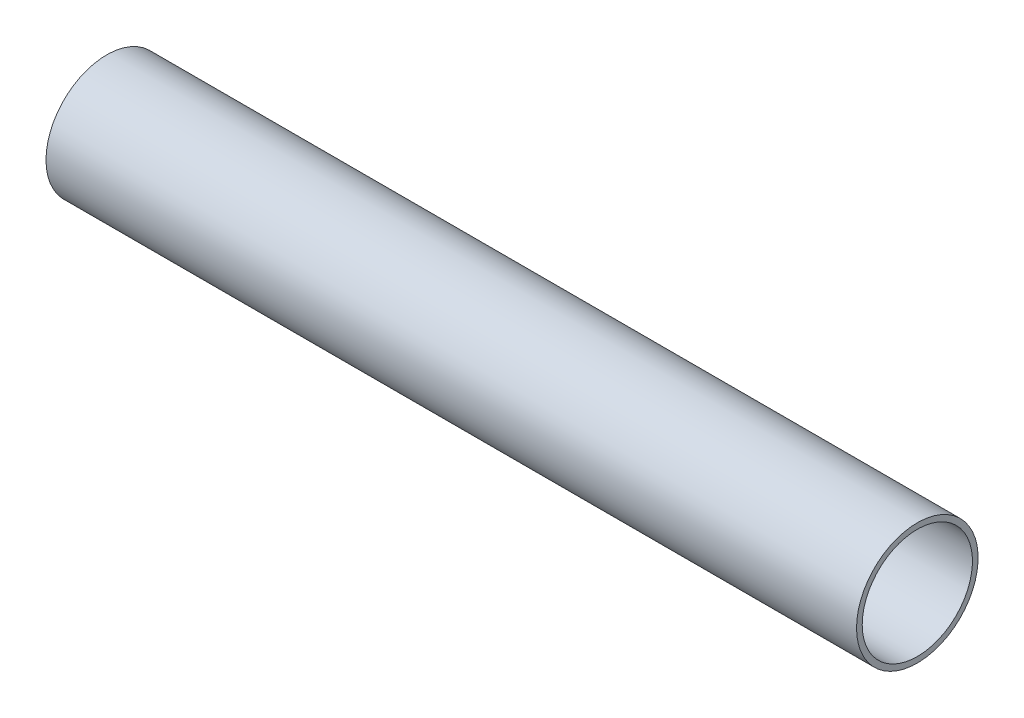
ISO-10303-21;
HEADER;
FILE_DESCRIPTION(('STEP AP214'),'2;1');
FILE_NAME('part.step','',(''),(''),'','','');
FILE_SCHEMA(('AUTOMOTIVE_DESIGN { 1 0 10303 214 1 1 1 1 }'));
ENDSEC;
DATA;
#1=APPLICATION_CONTEXT('core data for automotive mechanical design processes');
#2=APPLICATION_PROTOCOL_DEFINITION('international standard','automotive_design',2000,#1);
#3=PRODUCT_CONTEXT('',#1,'mechanical');
#4=PRODUCT('Part','Part','',(#3));
#5=PRODUCT_RELATED_PRODUCT_CATEGORY('part','',(#4));
#6=PRODUCT_DEFINITION_FORMATION('','',#4);
#7=PRODUCT_DEFINITION_CONTEXT('part definition',#1,'design');
#8=PRODUCT_DEFINITION('design','',#6,#7);
#9=PRODUCT_DEFINITION_SHAPE('','',#8);
#10=(LENGTH_UNIT() NAMED_UNIT(*) SI_UNIT(.MILLI.,.METRE.));
#11=(NAMED_UNIT(*) PLANE_ANGLE_UNIT() SI_UNIT($,.RADIAN.));
#12=(NAMED_UNIT(*) SI_UNIT($,.STERADIAN.) SOLID_ANGLE_UNIT());
#13=UNCERTAINTY_MEASURE_WITH_UNIT(LENGTH_MEASURE(1.E-05),#10,'distance_accuracy_value','');
#14=(GEOMETRIC_REPRESENTATION_CONTEXT(3) GLOBAL_UNCERTAINTY_ASSIGNED_CONTEXT((#13)) GLOBAL_UNIT_ASSIGNED_CONTEXT((#10,
#11,#12)) REPRESENTATION_CONTEXT('',''));
#15=CARTESIAN_POINT('',(0.,0.,0.));
#16=DIRECTION('',(0.,0.,1.));
#17=DIRECTION('',(1.,0.,0.));
#18=AXIS2_PLACEMENT_3D('',#15,#16,#17);
#19=CARTESIAN_POINT('',(0.,0.,-8.63599999999999));
#20=DIRECTION('',(1.,0.,0.));
#21=DIRECTION('',(0.,0.,-1.));
#22=AXIS2_PLACEMENT_3D('',#19,#20,#21);
#23=PLANE('',#22);
#24=CARTESIAN_POINT('',(0.,0.,0.));
#25=DIRECTION('',(-1.,0.,0.));
#26=DIRECTION('',(0.,0.,1.));
#27=AXIS2_PLACEMENT_3D('',#24,#25,#26);
#28=CIRCLE('',#27,8.63599999999999);
#29=CARTESIAN_POINT('',(0.,0.,8.63599999999999));
#30=VERTEX_POINT('',#29);
#31=EDGE_CURVE('E42',#30,#30,#28,.T.);
#32=ORIENTED_EDGE('',*,*,#31,.F.);
#33=EDGE_LOOP('',(#32));
#34=FACE_BOUND('',#33,.T.);
#35=CARTESIAN_POINT('',(0.,0.,0.));
#36=DIRECTION('',(-1.,0.,0.));
#37=DIRECTION('',(0.,0.,1.));
#38=AXIS2_PLACEMENT_3D('',#35,#36,#37);
#39=CIRCLE('',#38,9.525);
#40=CARTESIAN_POINT('',(0.,0.,9.525));
#41=VERTEX_POINT('',#40);
#42=EDGE_CURVE('E10',#41,#41,#39,.T.);
#43=ORIENTED_EDGE('',*,*,#42,.T.);
#44=EDGE_LOOP('',(#43));
#45=FACE_BOUND('',#44,.T.);
#46=ADVANCED_FACE('F28',(#34,#45),#23,.F.);
#47=CARTESIAN_POINT('',(0.,0.,0.));
#48=DIRECTION('',(-1.,0.,0.));
#49=DIRECTION('',(0.,0.,1.));
#50=AXIS2_PLACEMENT_3D('',#47,#48,#49);
#51=CYLINDRICAL_SURFACE('',#50,9.525);
#52=ORIENTED_EDGE('',*,*,#42,.F.);
#53=EDGE_LOOP('',(#52));
#54=FACE_BOUND('',#53,.T.);
#55=CARTESIAN_POINT('',(127.,0.,0.));
#56=DIRECTION('',(-1.,0.,0.));
#57=DIRECTION('',(0.,0.,1.));
#58=AXIS2_PLACEMENT_3D('',#55,#56,#57);
#59=CIRCLE('',#58,9.525);
#60=CARTESIAN_POINT('',(127.,0.,9.525));
#61=VERTEX_POINT('',#60);
#62=EDGE_CURVE('E34',#61,#61,#59,.T.);
#63=ORIENTED_EDGE('',*,*,#62,.T.);
#64=EDGE_LOOP('',(#63));
#65=FACE_BOUND('',#64,.T.);
#66=ADVANCED_FACE('F51',(#54,#65),#51,.T.);
#67=CARTESIAN_POINT('',(127.,0.,-9.525));
#68=DIRECTION('',(-1.,0.,0.));
#69=DIRECTION('',(0.,0.,1.));
#70=AXIS2_PLACEMENT_3D('',#67,#68,#69);
#71=PLANE('',#70);
#72=ORIENTED_EDGE('',*,*,#62,.F.);
#73=EDGE_LOOP('',(#72));
#74=FACE_BOUND('',#73,.T.);
#75=CARTESIAN_POINT('',(127.,0.,0.));
#76=DIRECTION('',(-1.,0.,0.));
#77=DIRECTION('',(0.,0.,1.));
#78=AXIS2_PLACEMENT_3D('',#75,#76,#77);
#79=CIRCLE('',#78,8.636);
#80=CARTESIAN_POINT('',(127.,0.,8.636));
#81=VERTEX_POINT('',#80);
#82=EDGE_CURVE('E38',#81,#81,#79,.T.);
#83=ORIENTED_EDGE('',*,*,#82,.T.);
#84=EDGE_LOOP('',(#83));
#85=FACE_BOUND('',#84,.T.);
#86=ADVANCED_FACE('F55',(#74,#85),#71,.F.);
#87=CARTESIAN_POINT('',(0.,0.,0.));
#88=DIRECTION('',(-1.,0.,0.));
#89=DIRECTION('',(0.,0.,1.));
#90=AXIS2_PLACEMENT_3D('',#87,#88,#89);
#91=CYLINDRICAL_SURFACE('',#90,8.63599999999999);
#92=ORIENTED_EDGE('',*,*,#82,.F.);
#93=EDGE_LOOP('',(#92));
#94=FACE_BOUND('',#93,.T.);
#95=ORIENTED_EDGE('',*,*,#31,.T.);
#96=EDGE_LOOP('',(#95));
#97=FACE_BOUND('',#96,.T.);
#98=ADVANCED_FACE('F48',(#94,#97),#91,.F.);
#99=CLOSED_SHELL('',(#46,#66,#86,#98));
#100=MANIFOLD_SOLID_BREP('B2',#99);
#101=ADVANCED_BREP_SHAPE_REPRESENTATION('',(#18,#100),#14);
#102=SHAPE_DEFINITION_REPRESENTATION(#9,#101);
ENDSEC;
END-ISO-10303-21;
